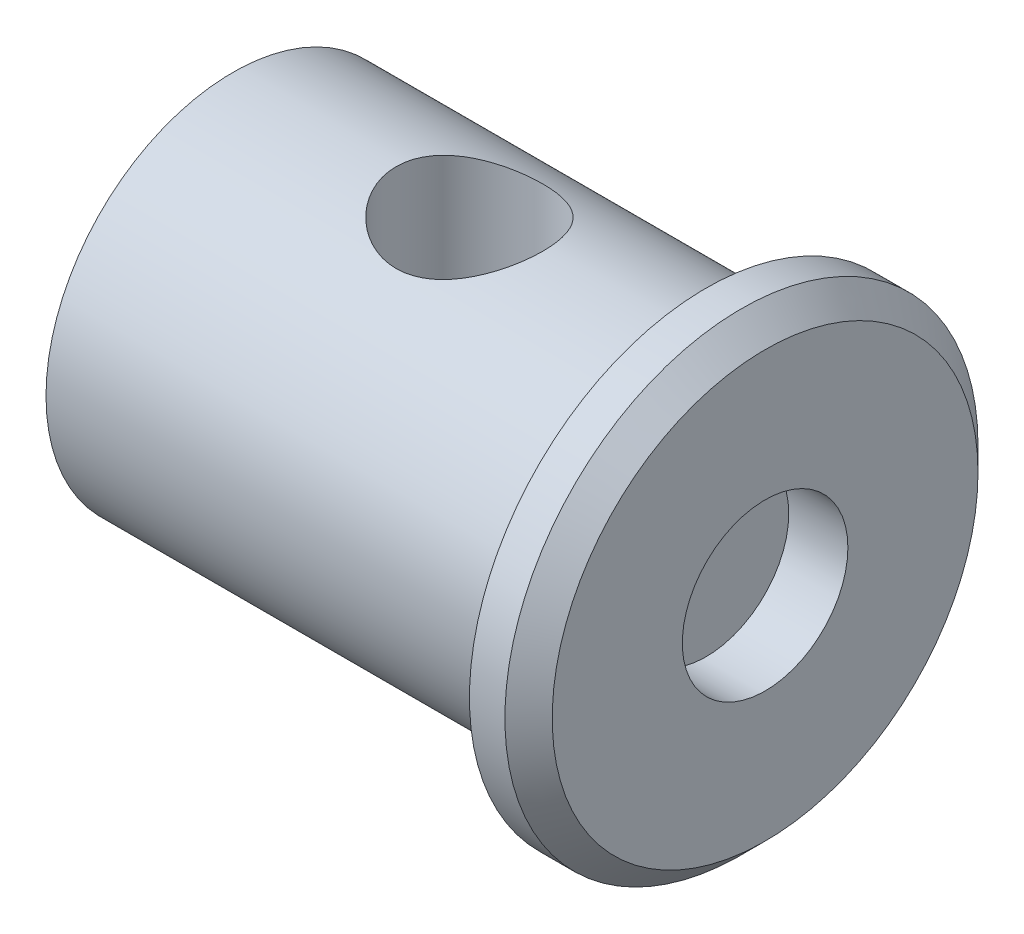
ISO-10303-21;
HEADER;
FILE_DESCRIPTION(('STEP AP214'),'2;1');
FILE_NAME('part.step','',(''),(''),'','','');
FILE_SCHEMA(('AUTOMOTIVE_DESIGN { 1 0 10303 214 1 1 1 1 }'));
ENDSEC;
DATA;
#1=APPLICATION_CONTEXT('core data for automotive mechanical design processes');
#2=APPLICATION_PROTOCOL_DEFINITION('international standard','automotive_design',2000,#1);
#3=PRODUCT_CONTEXT('',#1,'mechanical');
#4=PRODUCT('Part','Part','',(#3));
#5=PRODUCT_RELATED_PRODUCT_CATEGORY('part','',(#4));
#6=PRODUCT_DEFINITION_FORMATION('','',#4);
#7=PRODUCT_DEFINITION_CONTEXT('part definition',#1,'design');
#8=PRODUCT_DEFINITION('design','',#6,#7);
#9=PRODUCT_DEFINITION_SHAPE('','',#8);
#10=(LENGTH_UNIT() NAMED_UNIT(*) SI_UNIT(.MILLI.,.METRE.));
#11=(NAMED_UNIT(*) PLANE_ANGLE_UNIT() SI_UNIT($,.RADIAN.));
#12=(NAMED_UNIT(*) SI_UNIT($,.STERADIAN.) SOLID_ANGLE_UNIT());
#13=UNCERTAINTY_MEASURE_WITH_UNIT(LENGTH_MEASURE(1.E-05),#10,'distance_accuracy_value','');
#14=(GEOMETRIC_REPRESENTATION_CONTEXT(3) GLOBAL_UNCERTAINTY_ASSIGNED_CONTEXT((#13)) GLOBAL_UNIT_ASSIGNED_CONTEXT((#10,
#11,#12)) REPRESENTATION_CONTEXT('',''));
#15=CARTESIAN_POINT('',(0.,0.,0.));
#16=DIRECTION('',(0.,0.,1.));
#17=DIRECTION('',(1.,0.,0.));
#18=AXIS2_PLACEMENT_3D('',#15,#16,#17);
#19=CARTESIAN_POINT('',(-20.,0.,0.));
#20=DIRECTION('',(1.,0.,0.));
#21=DIRECTION('',(0.,0.,-1.));
#22=AXIS2_PLACEMENT_3D('',#19,#20,#21);
#23=CYLINDRICAL_SURFACE('',#22,7.9);
#24=CARTESIAN_POINT('',(-10.,-7.26636084983398,3.1));
#25=CARTESIAN_POINT('',(-10.1663346158653,-7.26636710949805,3.09999351847052));
#26=CARTESIAN_POINT('',(-10.332955051347,-7.27215151188825,3.08653260810271));
#27=CARTESIAN_POINT('',(-10.6614156667575,-7.29454929489087,3.03320818850061));
#28=CARTESIAN_POINT('',(-10.8232421978606,-7.3111909710545,2.993275686265));
#29=CARTESIAN_POINT('',(-11.136837463668,-7.35311644879813,2.88873826778125));
#30=CARTESIAN_POINT('',(-11.288640815679,-7.37836842341094,2.82422411303483));
#31=CARTESIAN_POINT('',(-11.5792296993829,-7.43462186683479,2.67262213711969));
#32=CARTESIAN_POINT('',(-11.7180184258771,-7.46562191902808,2.58553987577835));
#33=CARTESIAN_POINT('',(-11.9863577176001,-7.53178988522266,2.38614625265946));
#34=CARTESIAN_POINT('',(-12.1151025114832,-7.56708854791225,2.27279336643924));
#35=CARTESIAN_POINT('',(-12.3523408001219,-7.63679417086448,2.02627051594455));
#36=CARTESIAN_POINT('',(-12.4608273547092,-7.67120082207378,1.89309378829751));
#37=CARTESIAN_POINT('',(-12.6584190684678,-7.73680588764178,1.60452776876883));
#38=CARTESIAN_POINT('',(-12.746638915474,-7.76783435643637,1.44849015051636));
#39=CARTESIAN_POINT('',(-12.8952363077978,-7.82160938152175,1.12235484500192));
#40=CARTESIAN_POINT('',(-12.9556247803773,-7.84435918747372,0.952262706866209));
#41=CARTESIAN_POINT('',(-13.043990008852,-7.8780889029301,0.611288894812918));
#42=CARTESIAN_POINT('',(-13.0733510058438,-7.88956968563781,0.440816487760337));
#43=CARTESIAN_POINT('',(-13.1032782997886,-7.90127416736964,0.0970035923543548));
#44=CARTESIAN_POINT('',(-13.1038549176573,-7.9015019012822,-0.076335845696459));
#45=CARTESIAN_POINT('',(-13.0769707233346,-7.89098374274002,-0.410982263764639));
#46=CARTESIAN_POINT('',(-13.0510248395394,-7.88083077517019,-0.572432918358042));
#47=CARTESIAN_POINT('',(-12.9744000798044,-7.85148454908576,-0.888475888709469));
#48=CARTESIAN_POINT('',(-12.9237193950644,-7.83229062943027,-1.04306770199381));
#49=CARTESIAN_POINT('',(-12.7984356728259,-7.78638595408502,-1.34376022091283));
#50=CARTESIAN_POINT('',(-12.7234864867021,-7.75956716218171,-1.48969952838417));
#51=CARTESIAN_POINT('',(-12.5521117557785,-7.70109054775388,-1.76730265121786));
#52=CARTESIAN_POINT('',(-12.4556789739854,-7.66943109572801,-1.89896163381683));
#53=CARTESIAN_POINT('',(-12.2369345031472,-7.60213011382686,-2.15313469104066));
#54=CARTESIAN_POINT('',(-12.1133687799584,-7.56636337963099,-2.27453800786141));
#55=CARTESIAN_POINT('',(-11.8474682063288,-7.4964461076441,-2.49534358123238));
#56=CARTESIAN_POINT('',(-11.7051276940868,-7.4622960616265,-2.59473917672858));
#57=CARTESIAN_POINT('',(-11.400934093372,-7.39864628524178,-2.77111583740954));
#58=CARTESIAN_POINT('',(-11.2386662882743,-7.36929247480008,-2.84743866932457));
#59=CARTESIAN_POINT('',(-10.9021231218695,-7.32026092803281,-2.97123993980027));
#60=CARTESIAN_POINT('',(-10.7278552863409,-7.30057718904606,-3.01873627662334));
#61=CARTESIAN_POINT('',(-10.3833103877494,-7.27455842500945,-3.08088870825382));
#62=CARTESIAN_POINT('',(-10.2134097779068,-7.26750084415873,-3.09732569005301));
#63=CARTESIAN_POINT('',(-9.87316855726061,-7.26547874677008,-3.10206978071329));
#64=CARTESIAN_POINT('',(-9.70282808611748,-7.27051077392634,-3.09038492934167));
#65=CARTESIAN_POINT('',(-9.37619241535563,-7.29136168311245,-3.0408365957478));
#66=CARTESIAN_POINT('',(-9.2196352061247,-7.30658412661715,-3.00441907668648));
#67=CARTESIAN_POINT('',(-8.91494687702002,-7.34537082896779,-2.9082973888063));
#68=CARTESIAN_POINT('',(-8.7668175894863,-7.36893689384266,-2.84858817807036));
#69=CARTESIAN_POINT('',(-8.47664372940254,-7.4229011344714,-2.70492734752463));
#70=CARTESIAN_POINT('',(-8.33507352803402,-7.45353322003857,-2.62010812950565));
#71=CARTESIAN_POINT('',(-8.06754885592117,-7.51781026296112,-2.42953287787291));
#72=CARTESIAN_POINT('',(-7.94160058520701,-7.55145640747006,-2.32376857454228));
#73=CARTESIAN_POINT('',(-7.69966093866379,-7.62083862099281,-2.08548659754755));
#74=CARTESIAN_POINT('',(-7.58499967027524,-7.65655459372233,-1.95160756790945));
#75=CARTESIAN_POINT('',(-7.37957891402032,-7.72380524707335,-1.66564707700384));
#76=CARTESIAN_POINT('',(-7.28882009598321,-7.75533981050503,-1.51356510580068));
#77=CARTESIAN_POINT('',(-7.1342062589481,-7.8107333959728,-1.19519200109596));
#78=CARTESIAN_POINT('',(-7.07031544480831,-7.83460262013608,-1.02892012997483));
#79=CARTESIAN_POINT('',(-6.97181459682315,-7.87196334688755,-0.686826238081698));
#80=CARTESIAN_POINT('',(-6.93718933787567,-7.88546024523873,-0.511009233796531));
#81=CARTESIAN_POINT('',(-6.89996032354475,-7.89999893201714,-0.166782109029405));
#82=CARTESIAN_POINT('',(-6.8954732868068,-7.90177312742045,0.00139503627097649));
#83=CARTESIAN_POINT('',(-6.91371471932851,-7.89462371314277,0.336016966312012));
#84=CARTESIAN_POINT('',(-6.93643933294025,-7.88570161903031,0.502461993108065));
#85=CARTESIAN_POINT('',(-7.00711865150312,-7.85851915942147,0.824011500662934));
#86=CARTESIAN_POINT('',(-7.05433061774672,-7.84053412055966,0.979304350402064));
#87=CARTESIAN_POINT('',(-7.17187728788584,-7.79713434870136,1.27974962339401));
#88=CARTESIAN_POINT('',(-7.24221633143047,-7.77171822140757,1.42490013729913));
#89=CARTESIAN_POINT('',(-7.40748802949084,-7.71458712095708,1.70789189369715));
#90=CARTESIAN_POINT('',(-7.50335965698272,-7.68264574398632,1.84513809037886));
#91=CARTESIAN_POINT('',(-7.71554859015978,-7.6163358678509,2.10215993043256));
#92=CARTESIAN_POINT('',(-7.831873895833,-7.58196642216091,2.22192870424559));
#93=CARTESIAN_POINT('',(-8.08979780802798,-7.5121619951126,2.44790370354027));
#94=CARTESIAN_POINT('',(-8.23248343561413,-7.47678400107563,2.5528908434814));
#95=CARTESIAN_POINT('',(-8.53459850477329,-7.41118964250037,2.7375005231295));
#96=CARTESIAN_POINT('',(-8.69403018052225,-7.38097396810959,2.81711967263318));
#97=CARTESIAN_POINT('',(-9.01088245776391,-7.33185112675661,2.94246477377473));
#98=CARTESIAN_POINT('',(-9.16725518461086,-7.31218506218555,2.99054925616674));
#99=CARTESIAN_POINT('',(-9.48626384723518,-7.28278017018195,3.06147434223789));
#100=CARTESIAN_POINT('',(-9.64888076279454,-7.27301334718375,3.08438615105577));
#101=CARTESIAN_POINT('',(-9.84343005691292,-7.26797919196603,3.09620318071312));
#102=CARTESIAN_POINT('',(-9.87472061607179,-7.26737334317915,3.09762586595494));
#103=CARTESIAN_POINT('',(-9.93733740063212,-7.26656356990444,3.09952491572972));
#104=CARTESIAN_POINT('',(-9.96866362814162,-7.26635967055353,3.10000122107847));
#105=CARTESIAN_POINT('',(-10.,-7.26636084983398,3.1));
#106=B_SPLINE_CURVE_WITH_KNOTS('',3,(#24,#25,#26,#27,#28,#29,#30,#31,#32,#33,#34,#35,#36,#37,
#38,#39,#40,#41,#42,#43,#44,#45,#46,#47,#48,#49,#50,#51,#52,#53,#54,#55,#56,#57,#58,#59,#60,#61,
#62,#63,#64,#65,#66,#67,#68,#69,#70,#71,#72,#73,#74,#75,#76,#77,#78,#79,#80,#81,#82,#83,#84,#85,
#86,#87,#88,#89,#90,#91,#92,#93,#94,#95,#96,#97,#98,#99,#100,#101,#102,#103,#104,#105),
.UNSPECIFIED.,.T.,.F.,(4,2,2,2,2,2,2,2,2,2,2,2,2,2,2,2,2,2,2,2,2,2,2,2,2,2,2,2,2,2,2,2,2,2,2,2,
2,2,2,2,4),(0.,0.498874424301251,0.999054205742628,1.49740482089948,1.99563278004855,
2.51870508656055,3.04195626233955,3.58494241162901,4.1277151895949,4.64509354386725,
5.16228638582811,5.65150295746494,6.14075530976998,6.63731841942563,7.13404905561471,
7.66230622600663,8.19072306554441,8.7330368891427,9.27501364673122,9.78484159993364,
10.2945238154401,10.7767158069103,11.2590122357218,11.7604380692871,12.2620622762048,
12.7990899242406,13.336132620046,13.8724575516268,14.4085032936735,14.9107131357066,
15.4128518275076,15.9005807086209,16.3884011612398,16.8975012425558,17.4068008914588,
17.94618562104,18.4856424043234,18.977830198215,19.4686221428478,19.5626009988923,
19.6565857319511),.UNSPECIFIED.);
#107=CARTESIAN_POINT('',(-10.,-7.26636084983398,3.1));
#108=VERTEX_POINT('',#107);
#109=EDGE_CURVE('E55',#108,#108,#106,.T.);
#110=ORIENTED_EDGE('',*,*,#109,.F.);
#111=EDGE_LOOP('',(#110));
#112=FACE_BOUND('',#111,.T.);
#113=CARTESIAN_POINT('',(-10.,7.26636084983398,3.1));
#114=CARTESIAN_POINT('',(-9.83366538413467,7.26636710949805,3.09999351847052));
#115=CARTESIAN_POINT('',(-9.66704494865304,7.27215151188825,3.08653260810271));
#116=CARTESIAN_POINT('',(-9.33858433324254,7.29454929489087,3.03320818850061));
#117=CARTESIAN_POINT('',(-9.17675780213939,7.3111909710545,2.993275686265));
#118=CARTESIAN_POINT('',(-8.86316253633202,7.35311644879813,2.88873826778125));
#119=CARTESIAN_POINT('',(-8.71135918432105,7.37836842341094,2.82422411303483));
#120=CARTESIAN_POINT('',(-8.42077030061706,7.43462186683479,2.67262213711969));
#121=CARTESIAN_POINT('',(-8.28198157412286,7.46562191902808,2.58553987577835));
#122=CARTESIAN_POINT('',(-8.01364228239994,7.53178988522266,2.38614625265946));
#123=CARTESIAN_POINT('',(-7.88489748851683,7.56708854791225,2.27279336643924));
#124=CARTESIAN_POINT('',(-7.64765919987812,7.63679417086448,2.02627051594455));
#125=CARTESIAN_POINT('',(-7.5391726452908,7.67120082207378,1.89309378829751));
#126=CARTESIAN_POINT('',(-7.34158093153223,7.73680588764178,1.60452776876883));
#127=CARTESIAN_POINT('',(-7.25336108452604,7.76783435643637,1.44849015051636));
#128=CARTESIAN_POINT('',(-7.10476369220221,7.82160938152175,1.12235484500192));
#129=CARTESIAN_POINT('',(-7.04437521962266,7.84435918747372,0.952262706866209));
#130=CARTESIAN_POINT('',(-6.95600999114795,7.8780889029301,0.611288894812918));
#131=CARTESIAN_POINT('',(-6.92664899415624,7.88956968563781,0.440816487760337));
#132=CARTESIAN_POINT('',(-6.89672170021144,7.90127416736964,0.0970035923543552));
#133=CARTESIAN_POINT('',(-6.89614508234274,7.9015019012822,-0.076335845696459));
#134=CARTESIAN_POINT('',(-6.92302927666536,7.89098374274002,-0.41098226376464));
#135=CARTESIAN_POINT('',(-6.94897516046063,7.88083077517019,-0.572432918358043));
#136=CARTESIAN_POINT('',(-7.02559992019559,7.85148454908576,-0.88847588870947));
#137=CARTESIAN_POINT('',(-7.07628060493558,7.83229062943027,-1.04306770199381));
#138=CARTESIAN_POINT('',(-7.20156432717407,7.78638595408502,-1.34376022091283));
#139=CARTESIAN_POINT('',(-7.2765135132979,7.75956716218171,-1.48969952838417));
#140=CARTESIAN_POINT('',(-7.44788824422154,7.70109054775388,-1.76730265121787));
#141=CARTESIAN_POINT('',(-7.54432102601463,7.66943109572801,-1.89896163381683));
#142=CARTESIAN_POINT('',(-7.76306549685278,7.60213011382686,-2.15313469104066));
#143=CARTESIAN_POINT('',(-7.88663122004159,7.56636337963099,-2.27453800786141));
#144=CARTESIAN_POINT('',(-8.1525317936712,7.4964461076441,-2.49534358123238));
#145=CARTESIAN_POINT('',(-8.29487230591324,7.4622960616265,-2.59473917672858));
#146=CARTESIAN_POINT('',(-8.59906590662802,7.39864628524178,-2.77111583740954));
#147=CARTESIAN_POINT('',(-8.76133371172565,7.36929247480008,-2.84743866932457));
#148=CARTESIAN_POINT('',(-9.09787687813051,7.32026092803281,-2.97123993980027));
#149=CARTESIAN_POINT('',(-9.2721447136591,7.30057718904606,-3.01873627662334));
#150=CARTESIAN_POINT('',(-9.61668961225058,7.27455842500945,-3.08088870825382));
#151=CARTESIAN_POINT('',(-9.78659022209319,7.26750084415874,-3.09732569005301));
#152=CARTESIAN_POINT('',(-10.1268314427394,7.26547874677008,-3.10206978071329));
#153=CARTESIAN_POINT('',(-10.2971719138825,7.27051077392634,-3.09038492934167));
#154=CARTESIAN_POINT('',(-10.6238075846444,7.29136168311245,-3.0408365957478));
#155=CARTESIAN_POINT('',(-10.7803647938753,7.30658412661715,-3.00441907668648));
#156=CARTESIAN_POINT('',(-11.08505312298,7.34537082896779,-2.9082973888063));
#157=CARTESIAN_POINT('',(-11.2331824105137,7.36893689384266,-2.84858817807036));
#158=CARTESIAN_POINT('',(-11.5233562705975,7.4229011344714,-2.70492734752463));
#159=CARTESIAN_POINT('',(-11.664926471966,7.45353322003857,-2.62010812950565));
#160=CARTESIAN_POINT('',(-11.9324511440788,7.51781026296112,-2.42953287787291));
#161=CARTESIAN_POINT('',(-12.058399414793,7.55145640747006,-2.32376857454228));
#162=CARTESIAN_POINT('',(-12.3003390613362,7.62083862099281,-2.08548659754755));
#163=CARTESIAN_POINT('',(-12.4150003297248,7.65655459372233,-1.95160756790945));
#164=CARTESIAN_POINT('',(-12.6204210859797,7.72380524707335,-1.66564707700384));
#165=CARTESIAN_POINT('',(-12.7111799040168,7.75533981050503,-1.51356510580068));
#166=CARTESIAN_POINT('',(-12.8657937410519,7.8107333959728,-1.19519200109596));
#167=CARTESIAN_POINT('',(-12.9296845551917,7.83460262013608,-1.02892012997483));
#168=CARTESIAN_POINT('',(-13.0281854031769,7.87196334688755,-0.686826238081698));
#169=CARTESIAN_POINT('',(-13.0628106621243,7.88546024523873,-0.511009233796531));
#170=CARTESIAN_POINT('',(-13.1000396764553,7.89999893201714,-0.166782109029405));
#171=CARTESIAN_POINT('',(-13.1045267131932,7.90177312742045,0.00139503627097584));
#172=CARTESIAN_POINT('',(-13.0862852806715,7.89462371314277,0.336016966312011));
#173=CARTESIAN_POINT('',(-13.0635606670598,7.88570161903031,0.502461993108064));
#174=CARTESIAN_POINT('',(-12.9928813484969,7.85851915942147,0.824011500662934));
#175=CARTESIAN_POINT('',(-12.9456693822533,7.84053412055966,0.979304350402065));
#176=CARTESIAN_POINT('',(-12.8281227121142,7.79713434870136,1.27974962339401));
#177=CARTESIAN_POINT('',(-12.7577836685695,7.77171822140757,1.42490013729913));
#178=CARTESIAN_POINT('',(-12.5925119705092,7.71458712095708,1.70789189369715));
#179=CARTESIAN_POINT('',(-12.4966403430173,7.68264574398632,1.84513809037886));
#180=CARTESIAN_POINT('',(-12.2844514098402,7.6163358678509,2.10215993043256));
#181=CARTESIAN_POINT('',(-12.168126104167,7.58196642216091,2.22192870424559));
#182=CARTESIAN_POINT('',(-11.910202191972,7.5121619951126,2.44790370354027));
#183=CARTESIAN_POINT('',(-11.7675165643859,7.47678400107563,2.5528908434814));
#184=CARTESIAN_POINT('',(-11.4654014952267,7.41118964250037,2.7375005231295));
#185=CARTESIAN_POINT('',(-11.3059698194777,7.38097396810959,2.81711967263318));
#186=CARTESIAN_POINT('',(-10.9891175422361,7.33185112675661,2.94246477377473));
#187=CARTESIAN_POINT('',(-10.8327448153891,7.31218506218555,2.99054925616674));
#188=CARTESIAN_POINT('',(-10.5137361527648,7.28278017018195,3.06147434223789));
#189=CARTESIAN_POINT('',(-10.3511192372055,7.27301334718375,3.08438615105577));
#190=CARTESIAN_POINT('',(-10.1565699430871,7.26797919196603,3.09620318071312));
#191=CARTESIAN_POINT('',(-10.1252793839282,7.26737334317915,3.09762586595494));
#192=CARTESIAN_POINT('',(-10.0626625993679,7.26656356990444,3.09952491572972));
#193=CARTESIAN_POINT('',(-10.0313363718584,7.26635967055353,3.10000122107847));
#194=CARTESIAN_POINT('',(-10.,7.26636084983398,3.1));
#195=B_SPLINE_CURVE_WITH_KNOTS('',3,(#113,#114,#115,#116,#117,#118,#119,#120,#121,#122,#123,
#124,#125,#126,#127,#128,#129,#130,#131,#132,#133,#134,#135,#136,#137,#138,#139,#140,#141,#142,
#143,#144,#145,#146,#147,#148,#149,#150,#151,#152,#153,#154,#155,#156,#157,#158,#159,#160,#161,
#162,#163,#164,#165,#166,#167,#168,#169,#170,#171,#172,#173,#174,#175,#176,#177,#178,#179,#180,
#181,#182,#183,#184,#185,#186,#187,#188,#189,#190,#191,#192,#193,#194),.UNSPECIFIED.,.T.,.F.,(4,
2,2,2,2,2,2,2,2,2,2,2,2,2,2,2,2,2,2,2,2,2,2,2,2,2,2,2,2,2,2,2,2,2,2,2,2,2,2,2,4),(0.,
0.498874424301251,0.999054205742628,1.49740482089948,1.99563278004855,2.51870508656055,
3.04195626233955,3.58494241162901,4.1277151895949,4.64509354386725,5.16228638582811,
5.65150295746495,6.14075530976998,6.63731841942563,7.13404905561471,7.66230622600664,
8.19072306554442,8.7330368891427,9.27501364673122,9.78484159993364,10.2945238154401,
10.7767158069103,11.2590122357218,11.7604380692871,12.2620622762048,12.7990899242406,
13.336132620046,13.8724575516268,14.4085032936735,14.9107131357066,15.4128518275076,
15.9005807086209,16.3884011612398,16.8975012425558,17.4068008914588,17.94618562104,
18.4856424043234,18.977830198215,19.4686221428478,19.5626009988923,19.6565857319511),.UNSPECIFIED.);
#196=CARTESIAN_POINT('',(-10.,7.26636084983398,3.1));
#197=VERTEX_POINT('',#196);
#198=EDGE_CURVE('E62',#197,#197,#195,.T.);
#199=ORIENTED_EDGE('',*,*,#198,.F.);
#200=EDGE_LOOP('',(#199));
#201=FACE_BOUND('',#200,.T.);
#202=CARTESIAN_POINT('',(-20.,0.,0.));
#203=DIRECTION('',(1.,0.,0.));
#204=DIRECTION('',(0.,0.,-1.));
#205=AXIS2_PLACEMENT_3D('',#202,#203,#204);
#206=CIRCLE('',#205,7.9);
#207=CARTESIAN_POINT('',(-20.,0.,-7.9));
#208=VERTEX_POINT('',#207);
#209=EDGE_CURVE('E48',#208,#208,#206,.T.);
#210=ORIENTED_EDGE('',*,*,#209,.T.);
#211=EDGE_LOOP('',(#210));
#212=FACE_BOUND('',#211,.T.);
#213=CARTESIAN_POINT('',(0.,0.,0.));
#214=DIRECTION('',(1.,0.,0.));
#215=DIRECTION('',(0.,0.,-1.));
#216=AXIS2_PLACEMENT_3D('',#213,#214,#215);
#217=CIRCLE('',#216,7.9);
#218=CARTESIAN_POINT('',(0.,0.,-7.9));
#219=VERTEX_POINT('',#218);
#220=EDGE_CURVE('E52',#219,#219,#217,.T.);
#221=ORIENTED_EDGE('',*,*,#220,.F.);
#222=EDGE_LOOP('',(#221));
#223=FACE_BOUND('',#222,.T.);
#224=ADVANCED_FACE('F36',(#112,#201,#212,#223),#23,.T.);
#225=CARTESIAN_POINT('',(-20.,0.,0.));
#226=DIRECTION('',(1.,0.,0.));
#227=DIRECTION('',(0.,0.,-1.));
#228=AXIS2_PLACEMENT_3D('',#225,#226,#227);
#229=PLANE('',#228);
#230=ORIENTED_EDGE('',*,*,#209,.F.);
#231=EDGE_LOOP('',(#230));
#232=FACE_BOUND('',#231,.T.);
#233=ADVANCED_FACE('F74',(#232),#229,.F.);
#234=CARTESIAN_POINT('',(-10.,-20.,0.));
#235=DIRECTION('',(0.,1.,0.));
#236=DIRECTION('',(0.,0.,1.));
#237=AXIS2_PLACEMENT_3D('',#234,#235,#236);
#238=CYLINDRICAL_SURFACE('',#237,3.1);
#239=ORIENTED_EDGE('',*,*,#109,.T.);
#240=EDGE_LOOP('',(#239));
#241=FACE_BOUND('',#240,.T.);
#242=ORIENTED_EDGE('',*,*,#198,.T.);
#243=EDGE_LOOP('',(#242));
#244=FACE_BOUND('',#243,.T.);
#245=ADVANCED_FACE('F69',(#241,#244),#238,.F.);
#246=CARTESIAN_POINT('',(2.5,0.,0.));
#247=DIRECTION('',(-1.,0.,0.));
#248=DIRECTION('',(0.,0.,1.));
#249=AXIS2_PLACEMENT_3D('',#246,#247,#248);
#250=CYLINDRICAL_SURFACE('',#249,10.);
#251=CARTESIAN_POINT('',(1.49999999999999,0.,0.));
#252=DIRECTION('',(1.,0.,0.));
#253=DIRECTION('',(0.,0.,-1.));
#254=AXIS2_PLACEMENT_3D('',#251,#252,#253);
#255=CIRCLE('',#254,10.);
#256=CARTESIAN_POINT('',(1.49999999999999,0.,-10.));
#257=VERTEX_POINT('',#256);
#258=EDGE_CURVE('E10',#257,#257,#255,.F.);
#259=ORIENTED_EDGE('',*,*,#258,.T.);
#260=EDGE_LOOP('',(#259));
#261=FACE_BOUND('',#260,.T.);
#262=CARTESIAN_POINT('',(0.,0.,0.));
#263=DIRECTION('',(1.,0.,0.));
#264=DIRECTION('',(0.,0.,-1.));
#265=AXIS2_PLACEMENT_3D('',#262,#263,#264);
#266=CIRCLE('',#265,10.);
#267=CARTESIAN_POINT('',(0.,0.,-10.));
#268=VERTEX_POINT('',#267);
#269=EDGE_CURVE('E91',#268,#268,#266,.T.);
#270=ORIENTED_EDGE('',*,*,#269,.T.);
#271=EDGE_LOOP('',(#270));
#272=FACE_BOUND('',#271,.T.);
#273=ADVANCED_FACE('F73',(#261,#272),#250,.T.);
#274=CARTESIAN_POINT('',(2.5,0.,0.));
#275=DIRECTION('',(1.,0.,0.));
#276=DIRECTION('',(0.,0.,-1.));
#277=AXIS2_PLACEMENT_3D('',#274,#275,#276);
#278=PLANE('',#277);
#279=CARTESIAN_POINT('',(2.5,0.,0.));
#280=DIRECTION('',(1.,0.,0.));
#281=DIRECTION('',(0.,0.,-1.));
#282=AXIS2_PLACEMENT_3D('',#279,#280,#281);
#283=CIRCLE('',#282,8.99999999999999);
#284=CARTESIAN_POINT('',(2.5,0.,-8.99999999999999));
#285=VERTEX_POINT('',#284);
#286=EDGE_CURVE('E44',#285,#285,#283,.T.);
#287=ORIENTED_EDGE('',*,*,#286,.T.);
#288=EDGE_LOOP('',(#287));
#289=FACE_BOUND('',#288,.T.);
#290=CARTESIAN_POINT('',(2.5,0.,0.));
#291=DIRECTION('',(1.,0.,0.));
#292=DIRECTION('',(0.,0.,-1.));
#293=AXIS2_PLACEMENT_3D('',#290,#291,#292);
#294=CIRCLE('',#293,3.5);
#295=CARTESIAN_POINT('',(2.5,0.,-3.5));
#296=VERTEX_POINT('',#295);
#297=EDGE_CURVE('E95',#296,#296,#294,.T.);
#298=ORIENTED_EDGE('',*,*,#297,.F.);
#299=EDGE_LOOP('',(#298));
#300=FACE_BOUND('',#299,.T.);
#301=ADVANCED_FACE('F110',(#289,#300),#278,.T.);
#302=CARTESIAN_POINT('',(0.,0.,0.));
#303=DIRECTION('',(1.,0.,0.));
#304=DIRECTION('',(0.,0.,-1.));
#305=AXIS2_PLACEMENT_3D('',#302,#303,#304);
#306=PLANE('',#305);
#307=ORIENTED_EDGE('',*,*,#220,.T.);
#308=EDGE_LOOP('',(#307));
#309=FACE_BOUND('',#308,.T.);
#310=ORIENTED_EDGE('',*,*,#269,.F.);
#311=EDGE_LOOP('',(#310));
#312=FACE_BOUND('',#311,.T.);
#313=ADVANCED_FACE('F106',(#309,#312),#306,.F.);
#314=CARTESIAN_POINT('',(0.,0.,0.));
#315=DIRECTION('',(1.,0.,0.));
#316=DIRECTION('',(0.,0.,-1.));
#317=AXIS2_PLACEMENT_3D('',#314,#315,#316);
#318=CYLINDRICAL_SURFACE('',#317,3.5);
#319=CARTESIAN_POINT('',(0.,0.,0.));
#320=DIRECTION('',(1.,0.,0.));
#321=DIRECTION('',(0.,0.,-1.));
#322=AXIS2_PLACEMENT_3D('',#319,#320,#321);
#323=CIRCLE('',#322,3.5);
#324=CARTESIAN_POINT('',(0.,0.,-3.5));
#325=VERTEX_POINT('',#324);
#326=EDGE_CURVE('E94',#325,#325,#323,.T.);
#327=ORIENTED_EDGE('',*,*,#326,.F.);
#328=EDGE_LOOP('',(#327));
#329=FACE_BOUND('',#328,.T.);
#330=ORIENTED_EDGE('',*,*,#297,.T.);
#331=EDGE_LOOP('',(#330));
#332=FACE_BOUND('',#331,.T.);
#333=ADVANCED_FACE('F103',(#329,#332),#318,.F.);
#334=CARTESIAN_POINT('',(0.,0.,0.));
#335=DIRECTION('',(1.,0.,0.));
#336=DIRECTION('',(0.,0.,-1.));
#337=AXIS2_PLACEMENT_3D('',#334,#335,#336);
#338=PLANE('',#337);
#339=ORIENTED_EDGE('',*,*,#326,.T.);
#340=EDGE_LOOP('',(#339));
#341=FACE_BOUND('',#340,.T.);
#342=ADVANCED_FACE('F101',(#341),#338,.T.);
#343=CARTESIAN_POINT('',(2.5,0.,0.));
#344=DIRECTION('',(-1.,0.,0.));
#345=DIRECTION('',(0.,0.,1.));
#346=AXIS2_PLACEMENT_3D('',#343,#344,#345);
#347=CONICAL_SURFACE('',#346,8.99999999999999,0.785398163397448);
#348=ORIENTED_EDGE('',*,*,#258,.F.);
#349=EDGE_LOOP('',(#348));
#350=FACE_BOUND('',#349,.T.);
#351=ORIENTED_EDGE('',*,*,#286,.F.);
#352=EDGE_LOOP('',(#351));
#353=FACE_BOUND('',#352,.T.);
#354=ADVANCED_FACE('F39',(#350,#353),#347,.T.);
#355=CLOSED_SHELL('',(#224,#233,#245,#273,#301,#313,#333,#342,#354));
#356=MANIFOLD_SOLID_BREP('B2',#355);
#357=ADVANCED_BREP_SHAPE_REPRESENTATION('',(#18,#356),#14);
#358=SHAPE_DEFINITION_REPRESENTATION(#9,#357);
ENDSEC;
END-ISO-10303-21;
